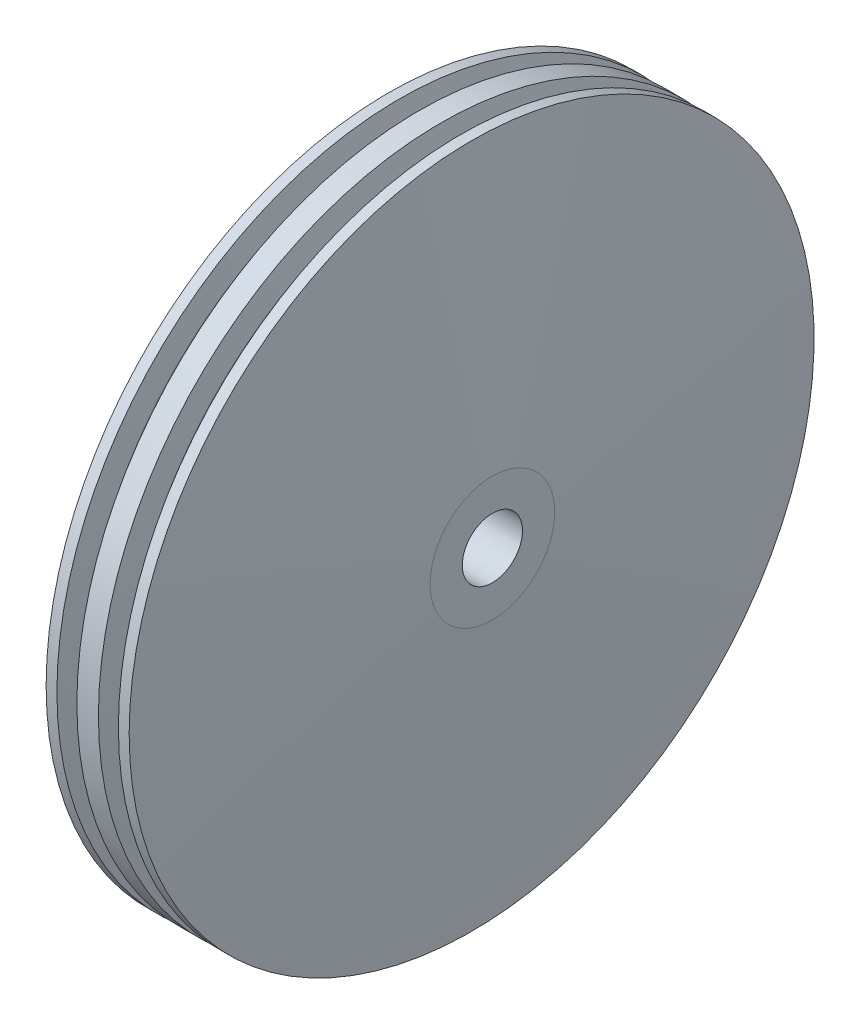
ISO-10303-21;
HEADER;
FILE_DESCRIPTION(('STEP AP214'),'2;1');
FILE_NAME('part.step','',(''),(''),'','','');
FILE_SCHEMA(('AUTOMOTIVE_DESIGN { 1 0 10303 214 1 1 1 1 }'));
ENDSEC;
DATA;
#1=APPLICATION_CONTEXT('core data for automotive mechanical design processes');
#2=APPLICATION_PROTOCOL_DEFINITION('international standard','automotive_design',2000,#1);
#3=PRODUCT_CONTEXT('',#1,'mechanical');
#4=PRODUCT('Part','Part','',(#3));
#5=PRODUCT_RELATED_PRODUCT_CATEGORY('part','',(#4));
#6=PRODUCT_DEFINITION_FORMATION('','',#4);
#7=PRODUCT_DEFINITION_CONTEXT('part definition',#1,'design');
#8=PRODUCT_DEFINITION('design','',#6,#7);
#9=PRODUCT_DEFINITION_SHAPE('','',#8);
#10=(LENGTH_UNIT() NAMED_UNIT(*) SI_UNIT(.MILLI.,.METRE.));
#11=(NAMED_UNIT(*) PLANE_ANGLE_UNIT() SI_UNIT($,.RADIAN.));
#12=(NAMED_UNIT(*) SI_UNIT($,.STERADIAN.) SOLID_ANGLE_UNIT());
#13=UNCERTAINTY_MEASURE_WITH_UNIT(LENGTH_MEASURE(1.E-05),#10,'distance_accuracy_value','');
#14=(GEOMETRIC_REPRESENTATION_CONTEXT(3) GLOBAL_UNCERTAINTY_ASSIGNED_CONTEXT((#13)) GLOBAL_UNIT_ASSIGNED_CONTEXT((#10,
#11,#12)) REPRESENTATION_CONTEXT('',''));
#15=CARTESIAN_POINT('',(0.,0.,0.));
#16=DIRECTION('',(0.,0.,1.));
#17=DIRECTION('',(1.,0.,0.));
#18=AXIS2_PLACEMENT_3D('',#15,#16,#17);
#19=CARTESIAN_POINT('',(-34.867117453676,0.,0.));
#20=DIRECTION('',(-1.,0.,0.));
#21=DIRECTION('',(0.,0.,1.));
#22=AXIS2_PLACEMENT_3D('',#19,#20,#21);
#23=CYLINDRICAL_SURFACE('',#22,2.9);
#24=CARTESIAN_POINT('',(6.,0.,0.));
#25=DIRECTION('',(-1.,0.,0.));
#26=DIRECTION('',(0.,0.,1.));
#27=AXIS2_PLACEMENT_3D('',#24,#25,#26);
#28=CIRCLE('',#27,2.9);
#29=CARTESIAN_POINT('',(6.,0.,2.9));
#30=VERTEX_POINT('',#29);
#31=EDGE_CURVE('E12',#30,#30,#28,.T.);
#32=ORIENTED_EDGE('',*,*,#31,.F.);
#33=EDGE_LOOP('',(#32));
#34=FACE_BOUND('',#33,.T.);
#35=CARTESIAN_POINT('',(1.7,0.,0.));
#36=DIRECTION('',(-1.,0.,0.));
#37=DIRECTION('',(0.,0.,1.));
#38=AXIS2_PLACEMENT_3D('',#35,#36,#37);
#39=CIRCLE('',#38,2.9);
#40=CARTESIAN_POINT('',(1.7,0.,2.9));
#41=VERTEX_POINT('',#40);
#42=EDGE_CURVE('E103',#41,#41,#39,.T.);
#43=ORIENTED_EDGE('',*,*,#42,.T.);
#44=EDGE_LOOP('',(#43));
#45=FACE_BOUND('',#44,.T.);
#46=ADVANCED_FACE('F45',(#34,#45),#23,.F.);
#47=CARTESIAN_POINT('',(6.,6.,0.));
#48=DIRECTION('',(-1.,0.,0.));
#49=DIRECTION('',(0.,0.,1.));
#50=AXIS2_PLACEMENT_3D('',#47,#48,#49);
#51=PLANE('',#50);
#52=CARTESIAN_POINT('',(6.,0.,0.));
#53=DIRECTION('',(-1.,0.,0.));
#54=DIRECTION('',(0.,0.,1.));
#55=AXIS2_PLACEMENT_3D('',#52,#53,#54);
#56=CIRCLE('',#55,6.);
#57=CARTESIAN_POINT('',(6.,0.,6.));
#58=VERTEX_POINT('',#57);
#59=EDGE_CURVE('E51',#58,#58,#56,.T.);
#60=ORIENTED_EDGE('',*,*,#59,.F.);
#61=EDGE_LOOP('',(#60));
#62=FACE_BOUND('',#61,.T.);
#63=ORIENTED_EDGE('',*,*,#31,.T.);
#64=EDGE_LOOP('',(#63));
#65=FACE_BOUND('',#64,.T.);
#66=ADVANCED_FACE('F200',(#62,#65),#51,.F.);
#67=CARTESIAN_POINT('',(6.,0.,0.));
#68=DIRECTION('',(-1.,0.,0.));
#69=DIRECTION('',(0.,0.,1.));
#70=AXIS2_PLACEMENT_3D('',#67,#68,#69);
#71=CONICAL_SURFACE('',#70,6.,1.49685728913696);
#72=CARTESIAN_POINT('',(4.,0.,0.));
#73=DIRECTION('',(-1.,0.,0.));
#74=DIRECTION('',(0.,0.,1.));
#75=AXIS2_PLACEMENT_3D('',#72,#73,#74);
#76=CIRCLE('',#75,33.);
#77=CARTESIAN_POINT('',(4.,0.,33.));
#78=VERTEX_POINT('',#77);
#79=EDGE_CURVE('E55',#78,#78,#76,.T.);
#80=ORIENTED_EDGE('',*,*,#79,.F.);
#81=EDGE_LOOP('',(#80));
#82=FACE_BOUND('',#81,.T.);
#83=ORIENTED_EDGE('',*,*,#59,.T.);
#84=EDGE_LOOP('',(#83));
#85=FACE_BOUND('',#84,.T.);
#86=ADVANCED_FACE('F195',(#82,#85),#71,.T.);
#87=CARTESIAN_POINT('',(-34.867117453676,0.,0.));
#88=DIRECTION('',(-1.,0.,0.));
#89=DIRECTION('',(0.,0.,1.));
#90=AXIS2_PLACEMENT_3D('',#87,#88,#89);
#91=CYLINDRICAL_SURFACE('',#90,33.);
#92=CARTESIAN_POINT('',(2.96190992854838,0.,0.));
#93=DIRECTION('',(-1.,0.,0.));
#94=DIRECTION('',(0.,0.,1.));
#95=AXIS2_PLACEMENT_3D('',#92,#93,#94);
#96=CIRCLE('',#95,33.);
#97=CARTESIAN_POINT('',(2.96190992854838,0.,33.));
#98=VERTEX_POINT('',#97);
#99=EDGE_CURVE('E59',#98,#98,#96,.T.);
#100=ORIENTED_EDGE('',*,*,#99,.F.);
#101=EDGE_LOOP('',(#100));
#102=FACE_BOUND('',#101,.T.);
#103=ORIENTED_EDGE('',*,*,#79,.T.);
#104=EDGE_LOOP('',(#103));
#105=FACE_BOUND('',#104,.T.);
#106=ADVANCED_FACE('F189',(#102,#105),#91,.T.);
#107=CARTESIAN_POINT('',(2.96190992854838,0.,0.));
#108=DIRECTION('',(1.,0.,0.));
#109=DIRECTION('',(0.,0.,-1.));
#110=AXIS2_PLACEMENT_3D('',#107,#108,#109);
#111=CONICAL_SURFACE('',#110,33.,1.39626340159546);
#112=CARTESIAN_POINT('',(2.59088465180732,0.,0.));
#113=DIRECTION('',(-1.,0.,0.));
#114=DIRECTION('',(0.,0.,1.));
#115=AXIS2_PLACEMENT_3D('',#112,#113,#114);
#116=CIRCLE('',#115,30.8958110933998);
#117=CARTESIAN_POINT('',(2.59088465180732,0.,30.8958110933998));
#118=VERTEX_POINT('',#117);
#119=EDGE_CURVE('E64',#118,#118,#116,.T.);
#120=ORIENTED_EDGE('',*,*,#119,.F.);
#121=EDGE_LOOP('',(#120));
#122=FACE_BOUND('',#121,.T.);
#123=ORIENTED_EDGE('',*,*,#99,.T.);
#124=EDGE_LOOP('',(#123));
#125=FACE_BOUND('',#124,.T.);
#126=ADVANCED_FACE('F183',(#122,#125),#111,.T.);
#127=CARTESIAN_POINT('',(2.,0.,0.));
#128=DIRECTION('',(-1.,0.,0.));
#129=DIRECTION('',(0.,0.,1.));
#130=AXIS2_PLACEMENT_3D('',#127,#128,#129);
#131=TOROIDAL_SURFACE('',#130,31.,0.599999999999996);
#132=CARTESIAN_POINT('',(1.40911534819268,0.,0.));
#133=DIRECTION('',(-1.,0.,0.));
#134=DIRECTION('',(0.,0.,1.));
#135=AXIS2_PLACEMENT_3D('',#132,#133,#134);
#136=CIRCLE('',#135,30.8958110933998);
#137=CARTESIAN_POINT('',(1.40911534819268,0.,30.8958110933998));
#138=VERTEX_POINT('',#137);
#139=EDGE_CURVE('E67',#138,#138,#136,.T.);
#140=ORIENTED_EDGE('',*,*,#139,.F.);
#141=EDGE_LOOP('',(#140));
#142=FACE_BOUND('',#141,.T.);
#143=ORIENTED_EDGE('',*,*,#119,.T.);
#144=EDGE_LOOP('',(#143));
#145=FACE_BOUND('',#144,.T.);
#146=ADVANCED_FACE('F177',(#142,#145),#131,.F.);
#147=CARTESIAN_POINT('',(1.40911534819268,0.,0.));
#148=DIRECTION('',(-1.,0.,0.));
#149=DIRECTION('',(0.,0.,1.));
#150=AXIS2_PLACEMENT_3D('',#147,#148,#149);
#151=CONICAL_SURFACE('',#150,30.8958110933998,1.39626340159546);
#152=CARTESIAN_POINT('',(1.03809007145162,0.,0.));
#153=DIRECTION('',(-1.,0.,0.));
#154=DIRECTION('',(0.,0.,1.));
#155=AXIS2_PLACEMENT_3D('',#152,#153,#154);
#156=CIRCLE('',#155,33.);
#157=CARTESIAN_POINT('',(1.03809007145162,0.,33.));
#158=VERTEX_POINT('',#157);
#159=EDGE_CURVE('E70',#158,#158,#156,.T.);
#160=ORIENTED_EDGE('',*,*,#159,.F.);
#161=EDGE_LOOP('',(#160));
#162=FACE_BOUND('',#161,.T.);
#163=ORIENTED_EDGE('',*,*,#139,.T.);
#164=EDGE_LOOP('',(#163));
#165=FACE_BOUND('',#164,.T.);
#166=ADVANCED_FACE('F171',(#162,#165),#151,.T.);
#167=CARTESIAN_POINT('',(-34.867117453676,0.,0.));
#168=DIRECTION('',(-1.,0.,0.));
#169=DIRECTION('',(0.,0.,1.));
#170=AXIS2_PLACEMENT_3D('',#167,#168,#169);
#171=CYLINDRICAL_SURFACE('',#170,33.);
#172=CARTESIAN_POINT('',(-1.03809007145162,0.,0.));
#173=DIRECTION('',(-1.,0.,0.));
#174=DIRECTION('',(0.,0.,1.));
#175=AXIS2_PLACEMENT_3D('',#172,#173,#174);
#176=CIRCLE('',#175,33.);
#177=CARTESIAN_POINT('',(-1.03809007145162,0.,33.));
#178=VERTEX_POINT('',#177);
#179=EDGE_CURVE('E73',#178,#178,#176,.T.);
#180=ORIENTED_EDGE('',*,*,#179,.F.);
#181=EDGE_LOOP('',(#180));
#182=FACE_BOUND('',#181,.T.);
#183=ORIENTED_EDGE('',*,*,#159,.T.);
#184=EDGE_LOOP('',(#183));
#185=FACE_BOUND('',#184,.T.);
#186=ADVANCED_FACE('F165',(#182,#185),#171,.T.);
#187=CARTESIAN_POINT('',(-1.03809007145162,0.,0.));
#188=DIRECTION('',(1.,0.,0.));
#189=DIRECTION('',(0.,0.,-1.));
#190=AXIS2_PLACEMENT_3D('',#187,#188,#189);
#191=CONICAL_SURFACE('',#190,33.,1.39626340159546);
#192=CARTESIAN_POINT('',(-1.40911534819268,0.,0.));
#193=DIRECTION('',(-1.,0.,0.));
#194=DIRECTION('',(0.,0.,1.));
#195=AXIS2_PLACEMENT_3D('',#192,#193,#194);
#196=CIRCLE('',#195,30.8958110933998);
#197=CARTESIAN_POINT('',(-1.40911534819268,0.,30.8958110933998));
#198=VERTEX_POINT('',#197);
#199=EDGE_CURVE('E76',#198,#198,#196,.T.);
#200=ORIENTED_EDGE('',*,*,#199,.F.);
#201=EDGE_LOOP('',(#200));
#202=FACE_BOUND('',#201,.T.);
#203=ORIENTED_EDGE('',*,*,#179,.T.);
#204=EDGE_LOOP('',(#203));
#205=FACE_BOUND('',#204,.T.);
#206=ADVANCED_FACE('F159',(#202,#205),#191,.T.);
#207=CARTESIAN_POINT('',(-2.,0.,0.));
#208=DIRECTION('',(-1.,0.,0.));
#209=DIRECTION('',(0.,0.,1.));
#210=AXIS2_PLACEMENT_3D('',#207,#208,#209);
#211=TOROIDAL_SURFACE('',#210,31.,0.599999999999996);
#212=CARTESIAN_POINT('',(-2.59088465180732,0.,0.));
#213=DIRECTION('',(-1.,0.,0.));
#214=DIRECTION('',(0.,0.,1.));
#215=AXIS2_PLACEMENT_3D('',#212,#213,#214);
#216=CIRCLE('',#215,30.8958110933998);
#217=CARTESIAN_POINT('',(-2.59088465180732,0.,30.8958110933998));
#218=VERTEX_POINT('',#217);
#219=EDGE_CURVE('E79',#218,#218,#216,.T.);
#220=ORIENTED_EDGE('',*,*,#219,.F.);
#221=EDGE_LOOP('',(#220));
#222=FACE_BOUND('',#221,.T.);
#223=ORIENTED_EDGE('',*,*,#199,.T.);
#224=EDGE_LOOP('',(#223));
#225=FACE_BOUND('',#224,.T.);
#226=ADVANCED_FACE('F153',(#222,#225),#211,.F.);
#227=CARTESIAN_POINT('',(-2.59088465180732,0.,0.));
#228=DIRECTION('',(-1.,0.,0.));
#229=DIRECTION('',(0.,0.,1.));
#230=AXIS2_PLACEMENT_3D('',#227,#228,#229);
#231=CONICAL_SURFACE('',#230,30.8958110933998,1.39626340159546);
#232=CARTESIAN_POINT('',(-2.96190992854838,0.,0.));
#233=DIRECTION('',(-1.,0.,0.));
#234=DIRECTION('',(0.,0.,1.));
#235=AXIS2_PLACEMENT_3D('',#232,#233,#234);
#236=CIRCLE('',#235,33.);
#237=CARTESIAN_POINT('',(-2.96190992854838,0.,33.));
#238=VERTEX_POINT('',#237);
#239=EDGE_CURVE('E82',#238,#238,#236,.T.);
#240=ORIENTED_EDGE('',*,*,#239,.F.);
#241=EDGE_LOOP('',(#240));
#242=FACE_BOUND('',#241,.T.);
#243=ORIENTED_EDGE('',*,*,#219,.T.);
#244=EDGE_LOOP('',(#243));
#245=FACE_BOUND('',#244,.T.);
#246=ADVANCED_FACE('F147',(#242,#245),#231,.T.);
#247=CARTESIAN_POINT('',(-34.867117453676,0.,0.));
#248=DIRECTION('',(-1.,0.,0.));
#249=DIRECTION('',(0.,0.,1.));
#250=AXIS2_PLACEMENT_3D('',#247,#248,#249);
#251=CYLINDRICAL_SURFACE('',#250,33.);
#252=CARTESIAN_POINT('',(-4.,0.,0.));
#253=DIRECTION('',(-1.,0.,0.));
#254=DIRECTION('',(0.,0.,1.));
#255=AXIS2_PLACEMENT_3D('',#252,#253,#254);
#256=CIRCLE('',#255,33.);
#257=CARTESIAN_POINT('',(-4.,0.,33.));
#258=VERTEX_POINT('',#257);
#259=EDGE_CURVE('E85',#258,#258,#256,.T.);
#260=ORIENTED_EDGE('',*,*,#259,.F.);
#261=EDGE_LOOP('',(#260));
#262=FACE_BOUND('',#261,.T.);
#263=ORIENTED_EDGE('',*,*,#239,.T.);
#264=EDGE_LOOP('',(#263));
#265=FACE_BOUND('',#264,.T.);
#266=ADVANCED_FACE('F141',(#262,#265),#251,.T.);
#267=CARTESIAN_POINT('',(-4.,0.,0.));
#268=DIRECTION('',(1.,0.,0.));
#269=DIRECTION('',(0.,0.,-1.));
#270=AXIS2_PLACEMENT_3D('',#267,#268,#269);
#271=CONICAL_SURFACE('',#270,33.,1.49685728913696);
#272=CARTESIAN_POINT('',(-6.,0.,0.));
#273=DIRECTION('',(-1.,0.,0.));
#274=DIRECTION('',(0.,0.,1.));
#275=AXIS2_PLACEMENT_3D('',#272,#273,#274);
#276=CIRCLE('',#275,6.);
#277=CARTESIAN_POINT('',(-6.,0.,6.));
#278=VERTEX_POINT('',#277);
#279=EDGE_CURVE('E88',#278,#278,#276,.T.);
#280=ORIENTED_EDGE('',*,*,#279,.F.);
#281=EDGE_LOOP('',(#280));
#282=FACE_BOUND('',#281,.T.);
#283=ORIENTED_EDGE('',*,*,#259,.T.);
#284=EDGE_LOOP('',(#283));
#285=FACE_BOUND('',#284,.T.);
#286=ADVANCED_FACE('F135',(#282,#285),#271,.T.);
#287=CARTESIAN_POINT('',(-6.,2.9,0.));
#288=DIRECTION('',(1.,0.,0.));
#289=DIRECTION('',(0.,0.,-1.));
#290=AXIS2_PLACEMENT_3D('',#287,#288,#289);
#291=PLANE('',#290);
#292=CARTESIAN_POINT('',(-6.,0.,0.));
#293=DIRECTION('',(-1.,0.,0.));
#294=DIRECTION('',(0.,0.,1.));
#295=AXIS2_PLACEMENT_3D('',#292,#293,#294);
#296=CIRCLE('',#295,2.9);
#297=CARTESIAN_POINT('',(-6.,0.,2.9));
#298=VERTEX_POINT('',#297);
#299=EDGE_CURVE('E91',#298,#298,#296,.T.);
#300=ORIENTED_EDGE('',*,*,#299,.F.);
#301=EDGE_LOOP('',(#300));
#302=FACE_BOUND('',#301,.T.);
#303=ORIENTED_EDGE('',*,*,#279,.T.);
#304=EDGE_LOOP('',(#303));
#305=FACE_BOUND('',#304,.T.);
#306=ADVANCED_FACE('F129',(#302,#305),#291,.F.);
#307=CARTESIAN_POINT('',(-34.867117453676,0.,0.));
#308=DIRECTION('',(-1.,0.,0.));
#309=DIRECTION('',(0.,0.,1.));
#310=AXIS2_PLACEMENT_3D('',#307,#308,#309);
#311=CYLINDRICAL_SURFACE('',#310,2.9);
#312=CARTESIAN_POINT('',(-2.3,0.,0.));
#313=DIRECTION('',(-1.,0.,0.));
#314=DIRECTION('',(0.,0.,1.));
#315=AXIS2_PLACEMENT_3D('',#312,#313,#314);
#316=CIRCLE('',#315,2.9);
#317=CARTESIAN_POINT('',(-2.3,0.,2.9));
#318=VERTEX_POINT('',#317);
#319=EDGE_CURVE('E94',#318,#318,#316,.T.);
#320=ORIENTED_EDGE('',*,*,#319,.F.);
#321=EDGE_LOOP('',(#320));
#322=FACE_BOUND('',#321,.T.);
#323=ORIENTED_EDGE('',*,*,#299,.T.);
#324=EDGE_LOOP('',(#323));
#325=FACE_BOUND('',#324,.T.);
#326=ADVANCED_FACE('F123',(#322,#325),#311,.F.);
#327=CARTESIAN_POINT('',(-2.3,1.5,0.));
#328=DIRECTION('',(1.,0.,0.));
#329=DIRECTION('',(0.,0.,-1.));
#330=AXIS2_PLACEMENT_3D('',#327,#328,#329);
#331=PLANE('',#330);
#332=CARTESIAN_POINT('',(-2.3,0.,0.));
#333=DIRECTION('',(-1.,0.,0.));
#334=DIRECTION('',(0.,0.,1.));
#335=AXIS2_PLACEMENT_3D('',#332,#333,#334);
#336=CIRCLE('',#335,1.5);
#337=CARTESIAN_POINT('',(-2.3,0.,1.5));
#338=VERTEX_POINT('',#337);
#339=EDGE_CURVE('E97',#338,#338,#336,.T.);
#340=ORIENTED_EDGE('',*,*,#339,.F.);
#341=EDGE_LOOP('',(#340));
#342=FACE_BOUND('',#341,.T.);
#343=ORIENTED_EDGE('',*,*,#319,.T.);
#344=EDGE_LOOP('',(#343));
#345=FACE_BOUND('',#344,.T.);
#346=ADVANCED_FACE('F117',(#342,#345),#331,.F.);
#347=CARTESIAN_POINT('',(-34.867117453676,0.,0.));
#348=DIRECTION('',(-1.,0.,0.));
#349=DIRECTION('',(0.,0.,1.));
#350=AXIS2_PLACEMENT_3D('',#347,#348,#349);
#351=CYLINDRICAL_SURFACE('',#350,1.5);
#352=CARTESIAN_POINT('',(1.7,0.,0.));
#353=DIRECTION('',(-1.,0.,0.));
#354=DIRECTION('',(0.,0.,1.));
#355=AXIS2_PLACEMENT_3D('',#352,#353,#354);
#356=CIRCLE('',#355,1.5);
#357=CARTESIAN_POINT('',(1.7,0.,1.5));
#358=VERTEX_POINT('',#357);
#359=EDGE_CURVE('E100',#358,#358,#356,.T.);
#360=ORIENTED_EDGE('',*,*,#359,.F.);
#361=EDGE_LOOP('',(#360));
#362=FACE_BOUND('',#361,.T.);
#363=ORIENTED_EDGE('',*,*,#339,.T.);
#364=EDGE_LOOP('',(#363));
#365=FACE_BOUND('',#364,.T.);
#366=ADVANCED_FACE('F111',(#362,#365),#351,.F.);
#367=CARTESIAN_POINT('',(1.7,2.9,0.));
#368=DIRECTION('',(-1.,0.,0.));
#369=DIRECTION('',(0.,0.,1.));
#370=AXIS2_PLACEMENT_3D('',#367,#368,#369);
#371=PLANE('',#370);
#372=ORIENTED_EDGE('',*,*,#42,.F.);
#373=EDGE_LOOP('',(#372));
#374=FACE_BOUND('',#373,.T.);
#375=ORIENTED_EDGE('',*,*,#359,.T.);
#376=EDGE_LOOP('',(#375));
#377=FACE_BOUND('',#376,.T.);
#378=ADVANCED_FACE('F108',(#374,#377),#371,.F.);
#379=CLOSED_SHELL('',(#46,#66,#86,#106,#126,#146,#166,#186,#206,#226,#246,#266,#286,#306,#326,
#346,#366,#378));
#380=MANIFOLD_SOLID_BREP('B2',#379);
#381=ADVANCED_BREP_SHAPE_REPRESENTATION('',(#18,#380),#14);
#382=SHAPE_DEFINITION_REPRESENTATION(#9,#381);
ENDSEC;
END-ISO-10303-21;
